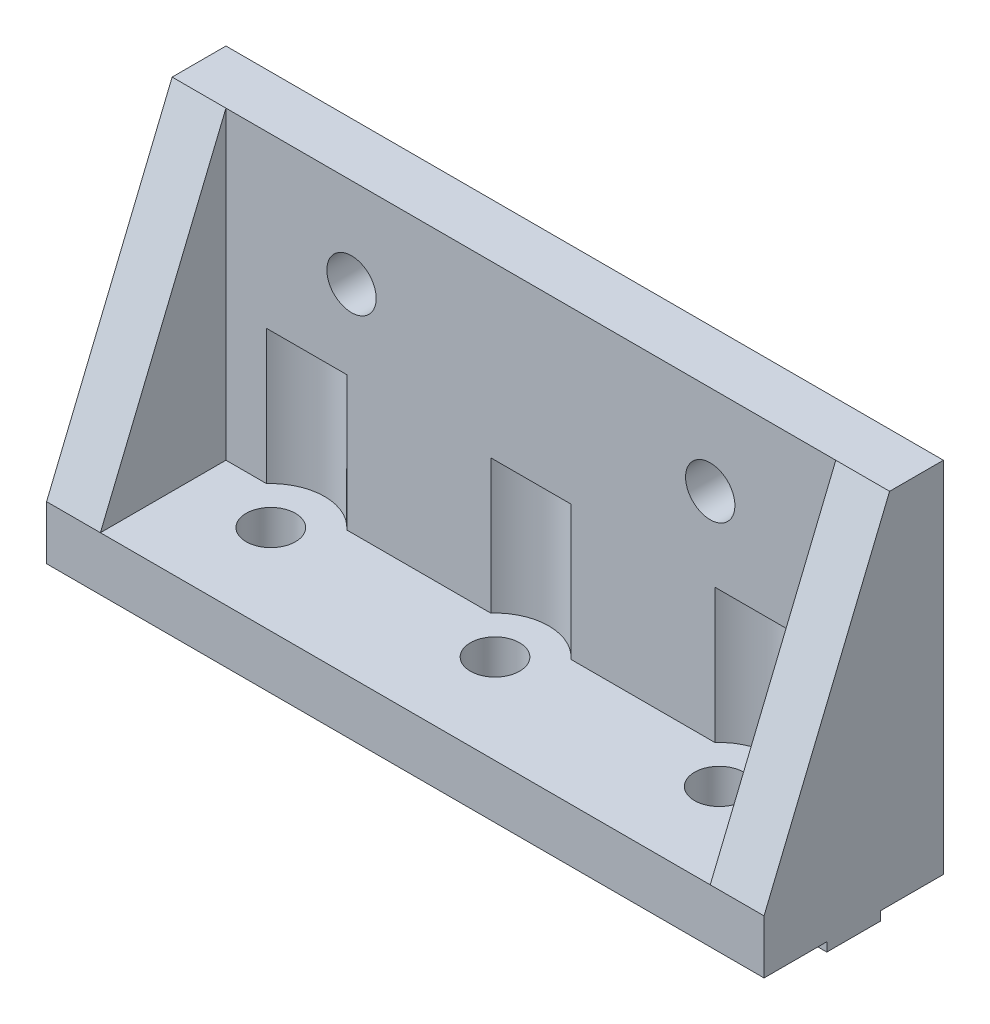
ISO-10303-21;
HEADER;
FILE_DESCRIPTION(('STEP AP214'),'2;1');
FILE_NAME('part.step','',(''),(''),'','','');
FILE_SCHEMA(('AUTOMOTIVE_DESIGN { 1 0 10303 214 1 1 1 1 }'));
ENDSEC;
DATA;
#1=APPLICATION_CONTEXT('core data for automotive mechanical design processes');
#2=APPLICATION_PROTOCOL_DEFINITION('international standard','automotive_design',2000,#1);
#3=PRODUCT_CONTEXT('',#1,'mechanical');
#4=PRODUCT('Part','Part','',(#3));
#5=PRODUCT_RELATED_PRODUCT_CATEGORY('part','',(#4));
#6=PRODUCT_DEFINITION_FORMATION('','',#4);
#7=PRODUCT_DEFINITION_CONTEXT('part definition',#1,'design');
#8=PRODUCT_DEFINITION('design','',#6,#7);
#9=PRODUCT_DEFINITION_SHAPE('','',#8);
#10=(LENGTH_UNIT() NAMED_UNIT(*) SI_UNIT(.MILLI.,.METRE.));
#11=(NAMED_UNIT(*) PLANE_ANGLE_UNIT() SI_UNIT($,.RADIAN.));
#12=(NAMED_UNIT(*) SI_UNIT($,.STERADIAN.) SOLID_ANGLE_UNIT());
#13=UNCERTAINTY_MEASURE_WITH_UNIT(LENGTH_MEASURE(1.E-05),#10,'distance_accuracy_value','');
#14=(GEOMETRIC_REPRESENTATION_CONTEXT(3) GLOBAL_UNCERTAINTY_ASSIGNED_CONTEXT((#13)) GLOBAL_UNIT_ASSIGNED_CONTEXT((#10,
#11,#12)) REPRESENTATION_CONTEXT('',''));
#15=CARTESIAN_POINT('',(0.,0.,0.));
#16=DIRECTION('',(0.,0.,1.));
#17=DIRECTION('',(1.,0.,0.));
#18=AXIS2_PLACEMENT_3D('',#15,#16,#17);
#19=CARTESIAN_POINT('',(6.,-34.,6.));
#20=DIRECTION('',(0.,0.,-1.));
#21=DIRECTION('',(-1.,0.,0.));
#22=AXIS2_PLACEMENT_3D('',#19,#20,#21);
#23=PLANE('',#22);
#24=CARTESIAN_POINT('',(20.,-10.,6.));
#25=DIRECTION('',(0.,0.,-1.));
#26=DIRECTION('',(-1.,0.,0.));
#27=AXIS2_PLACEMENT_3D('',#24,#25,#26);
#28=CIRCLE('',#27,2.75);
#29=CARTESIAN_POINT('',(17.25,-10.,6.));
#30=VERTEX_POINT('',#29);
#31=EDGE_CURVE('E303',#30,#30,#28,.F.);
#32=ORIENTED_EDGE('',*,*,#31,.F.);
#33=EDGE_LOOP('',(#32));
#34=FACE_BOUND('',#33,.T.);
#35=CARTESIAN_POINT('',(60.,-10.,6.));
#36=DIRECTION('',(0.,0.,-1.));
#37=DIRECTION('',(-1.,0.,0.));
#38=AXIS2_PLACEMENT_3D('',#35,#36,#37);
#39=CIRCLE('',#38,2.75000000000001);
#40=CARTESIAN_POINT('',(57.25,-10.,6.));
#41=VERTEX_POINT('',#40);
#42=EDGE_CURVE('E307',#41,#41,#39,.F.);
#43=ORIENTED_EDGE('',*,*,#42,.F.);
#44=EDGE_LOOP('',(#43));
#45=FACE_BOUND('',#44,.T.);
#46=DIRECTION('',(0.,-1.,0.));
#47=VECTOR('',#46,1.);
#48=CARTESIAN_POINT('',(19.4721359549996,-19.,6.));
#49=LINE('',#48,#47);
#50=CARTESIAN_POINT('',(19.4721359549996,-34.,6.));
#51=VERTEX_POINT('',#50);
#52=CARTESIAN_POINT('',(19.4721359549996,-19.,6.));
#53=VERTEX_POINT('',#52);
#54=EDGE_CURVE('E164',#51,#53,#49,.F.);
#55=ORIENTED_EDGE('',*,*,#54,.F.);
#56=DIRECTION('',(-1.,0.,0.));
#57=VECTOR('',#56,1.);
#58=CARTESIAN_POINT('',(6.,-34.,6.));
#59=LINE('',#58,#57);
#60=CARTESIAN_POINT('',(35.5278640450004,-34.,6.));
#61=VERTEX_POINT('',#60);
#62=EDGE_CURVE('E174',#61,#51,#59,.T.);
#63=ORIENTED_EDGE('',*,*,#62,.F.);
#64=DIRECTION('',(0.,-1.,0.));
#65=VECTOR('',#64,1.);
#66=CARTESIAN_POINT('',(35.5278640450004,-19.,6.));
#67=LINE('',#66,#65);
#68=CARTESIAN_POINT('',(35.5278640450004,-19.,6.));
#69=VERTEX_POINT('',#68);
#70=EDGE_CURVE('E235',#69,#61,#67,.T.);
#71=ORIENTED_EDGE('',*,*,#70,.F.);
#72=DIRECTION('',(1.,0.,0.));
#73=VECTOR('',#72,1.);
#74=CARTESIAN_POINT('',(6.,-19.,6.));
#75=LINE('',#74,#73);
#76=CARTESIAN_POINT('',(44.4721359549996,-19.,6.));
#77=VERTEX_POINT('',#76);
#78=EDGE_CURVE('E47',#69,#77,#75,.T.);
#79=ORIENTED_EDGE('',*,*,#78,.T.);
#80=DIRECTION('',(0.,-1.,0.));
#81=VECTOR('',#80,1.);
#82=CARTESIAN_POINT('',(44.4721359549996,-19.,6.));
#83=LINE('',#82,#81);
#84=CARTESIAN_POINT('',(44.4721359549996,-34.,6.));
#85=VERTEX_POINT('',#84);
#86=EDGE_CURVE('E234',#85,#77,#83,.F.);
#87=ORIENTED_EDGE('',*,*,#86,.F.);
#88=CARTESIAN_POINT('',(60.5278640450004,-34.,6.));
#89=VERTEX_POINT('',#88);
#90=EDGE_CURVE('E179',#89,#85,#59,.T.);
#91=ORIENTED_EDGE('',*,*,#90,.F.);
#92=DIRECTION('',(0.,-1.,0.));
#93=VECTOR('',#92,1.);
#94=CARTESIAN_POINT('',(60.5278640450004,-19.,6.));
#95=LINE('',#94,#93);
#96=CARTESIAN_POINT('',(60.5278640450004,-19.,6.));
#97=VERTEX_POINT('',#96);
#98=EDGE_CURVE('E251',#97,#89,#95,.T.);
#99=ORIENTED_EDGE('',*,*,#98,.F.);
#100=DIRECTION('',(1.,0.,0.));
#101=VECTOR('',#100,1.);
#102=CARTESIAN_POINT('',(6.,-19.,6.));
#103=LINE('',#102,#101);
#104=CARTESIAN_POINT('',(69.4721359549996,-19.,6.));
#105=VERTEX_POINT('',#104);
#106=EDGE_CURVE('E229',#97,#105,#103,.T.);
#107=ORIENTED_EDGE('',*,*,#106,.T.);
#108=DIRECTION('',(0.,-1.,0.));
#109=VECTOR('',#108,1.);
#110=CARTESIAN_POINT('',(69.4721359549996,-19.,6.));
#111=LINE('',#110,#109);
#112=CARTESIAN_POINT('',(69.4721359549996,-34.,6.));
#113=VERTEX_POINT('',#112);
#114=EDGE_CURVE('E254',#113,#105,#111,.F.);
#115=ORIENTED_EDGE('',*,*,#114,.F.);
#116=CARTESIAN_POINT('',(74.,-34.,6.));
#117=VERTEX_POINT('',#116);
#118=EDGE_CURVE('E182',#117,#113,#59,.T.);
#119=ORIENTED_EDGE('',*,*,#118,.F.);
#120=DIRECTION('',(0.,1.,0.));
#121=VECTOR('',#120,1.);
#122=CARTESIAN_POINT('',(74.,-34.,6.));
#123=LINE('',#122,#121);
#124=CARTESIAN_POINT('',(74.,0.,6.));
#125=VERTEX_POINT('',#124);
#126=EDGE_CURVE('E187',#117,#125,#123,.T.);
#127=ORIENTED_EDGE('',*,*,#126,.T.);
#128=DIRECTION('',(-1.,0.,0.));
#129=VECTOR('',#128,1.);
#130=CARTESIAN_POINT('',(6.,0.,6.));
#131=LINE('',#130,#129);
#132=CARTESIAN_POINT('',(6.00000000000003,0.,6.));
#133=VERTEX_POINT('',#132);
#134=EDGE_CURVE('E189',#125,#133,#131,.T.);
#135=ORIENTED_EDGE('',*,*,#134,.T.);
#136=DIRECTION('',(0.,1.,0.));
#137=VECTOR('',#136,1.);
#138=CARTESIAN_POINT('',(6.,-34.,6.));
#139=LINE('',#138,#137);
#140=CARTESIAN_POINT('',(6.,-34.,6.));
#141=VERTEX_POINT('',#140);
#142=EDGE_CURVE('E194',#141,#133,#139,.T.);
#143=ORIENTED_EDGE('',*,*,#142,.F.);
#144=CARTESIAN_POINT('',(10.5278640450004,-34.,6.));
#145=VERTEX_POINT('',#144);
#146=EDGE_CURVE('E180',#145,#141,#59,.T.);
#147=ORIENTED_EDGE('',*,*,#146,.F.);
#148=DIRECTION('',(0.,-1.,0.));
#149=VECTOR('',#148,1.);
#150=CARTESIAN_POINT('',(10.5278640450004,-19.,6.));
#151=LINE('',#150,#149);
#152=CARTESIAN_POINT('',(10.5278640450004,-19.,6.));
#153=VERTEX_POINT('',#152);
#154=EDGE_CURVE('E167',#153,#145,#151,.T.);
#155=ORIENTED_EDGE('',*,*,#154,.F.);
#156=DIRECTION('',(1.,0.,0.));
#157=VECTOR('',#156,1.);
#158=CARTESIAN_POINT('',(6.,-19.,6.));
#159=LINE('',#158,#157);
#160=EDGE_CURVE('E11',#153,#53,#159,.T.);
#161=ORIENTED_EDGE('',*,*,#160,.T.);
#162=EDGE_LOOP('',(#55,#63,#71,#79,#87,#91,#99,#107,#115,#119,#127,#135,#143,#147,#155,#161));
#163=FACE_BOUND('',#162,.T.);
#164=ADVANCED_FACE('F39',(#34,#45,#163),#23,.F.);
#165=CARTESIAN_POINT('',(0.,-40.,20.));
#166=DIRECTION('',(0.,1.,0.));
#167=DIRECTION('',(0.,0.,1.));
#168=AXIS2_PLACEMENT_3D('',#165,#166,#167);
#169=PLANE('',#168);
#170=DIRECTION('',(-1.,0.,0.));
#171=VECTOR('',#170,1.);
#172=CARTESIAN_POINT('',(0.,-40.,13.));
#173=LINE('',#172,#171);
#174=CARTESIAN_POINT('',(80.,-40.,13.));
#175=VERTEX_POINT('',#174);
#176=CARTESIAN_POINT('',(0.,-40.,13.));
#177=VERTEX_POINT('',#176);
#178=EDGE_CURVE('E281',#175,#177,#173,.T.);
#179=ORIENTED_EDGE('',*,*,#178,.F.);
#180=DIRECTION('',(0.,0.,-1.));
#181=VECTOR('',#180,1.);
#182=CARTESIAN_POINT('',(80.,-40.,20.));
#183=LINE('',#182,#181);
#184=CARTESIAN_POINT('',(80.,-40.,20.));
#185=VERTEX_POINT('',#184);
#186=EDGE_CURVE('E223',#185,#175,#183,.T.);
#187=ORIENTED_EDGE('',*,*,#186,.F.);
#188=DIRECTION('',(1.,0.,0.));
#189=VECTOR('',#188,1.);
#190=CARTESIAN_POINT('',(0.,-40.,20.));
#191=LINE('',#190,#189);
#192=CARTESIAN_POINT('',(0.,-40.,20.));
#193=VERTEX_POINT('',#192);
#194=EDGE_CURVE('E202',#193,#185,#191,.T.);
#195=ORIENTED_EDGE('',*,*,#194,.F.);
#196=DIRECTION('',(0.,0.,-1.));
#197=VECTOR('',#196,1.);
#198=CARTESIAN_POINT('',(0.,-40.,20.));
#199=LINE('',#198,#197);
#200=EDGE_CURVE('E227',#193,#177,#199,.T.);
#201=ORIENTED_EDGE('',*,*,#200,.T.);
#202=EDGE_LOOP('',(#179,#187,#195,#201));
#203=FACE_BOUND('',#202,.T.);
#204=ADVANCED_FACE('F360',(#203),#169,.F.);
#205=DIRECTION('',(1.,0.,0.));
#206=VECTOR('',#205,1.);
#207=CARTESIAN_POINT('',(0.,-40.,7.));
#208=LINE('',#207,#206);
#209=CARTESIAN_POINT('',(0.,-40.,7.));
#210=VERTEX_POINT('',#209);
#211=CARTESIAN_POINT('',(80.,-40.,7.));
#212=VERTEX_POINT('',#211);
#213=EDGE_CURVE('E276',#210,#212,#208,.T.);
#214=ORIENTED_EDGE('',*,*,#213,.F.);
#215=CARTESIAN_POINT('',(0.,-40.,0.));
#216=VERTEX_POINT('',#215);
#217=EDGE_CURVE('E226',#210,#216,#199,.T.);
#218=ORIENTED_EDGE('',*,*,#217,.T.);
#219=DIRECTION('',(1.,0.,0.));
#220=VECTOR('',#219,1.);
#221=CARTESIAN_POINT('',(0.,-40.,0.));
#222=LINE('',#221,#220);
#223=CARTESIAN_POINT('',(80.,-40.,0.));
#224=VERTEX_POINT('',#223);
#225=EDGE_CURVE('E211',#216,#224,#222,.T.);
#226=ORIENTED_EDGE('',*,*,#225,.T.);
#227=EDGE_CURVE('E222',#212,#224,#183,.T.);
#228=ORIENTED_EDGE('',*,*,#227,.F.);
#229=EDGE_LOOP('',(#214,#218,#226,#228));
#230=FACE_BOUND('',#229,.T.);
#231=ADVANCED_FACE('F366',(#230),#169,.F.);
#232=CARTESIAN_POINT('',(0.,0.,20.));
#233=DIRECTION('',(1.,0.,0.));
#234=DIRECTION('',(0.,1.,0.));
#235=AXIS2_PLACEMENT_3D('',#232,#233,#234);
#236=PLANE('',#235);
#237=DIRECTION('',(0.,-1.,0.));
#238=VECTOR('',#237,1.);
#239=CARTESIAN_POINT('',(0.,0.,20.));
#240=LINE('',#239,#238);
#241=CARTESIAN_POINT('',(0.,-34.,20.));
#242=VERTEX_POINT('',#241);
#243=EDGE_CURVE('E200',#242,#193,#240,.T.);
#244=ORIENTED_EDGE('',*,*,#243,.F.);
#245=DIRECTION('',(0.,-0.924678098474716,0.380749805254295));
#246=VECTOR('',#245,1.);
#247=CARTESIAN_POINT('',(0.,-34.,20.));
#248=LINE('',#247,#246);
#249=CARTESIAN_POINT('',(0.,0.,6.));
#250=VERTEX_POINT('',#249);
#251=EDGE_CURVE('E311',#250,#242,#248,.T.);
#252=ORIENTED_EDGE('',*,*,#251,.F.);
#253=DIRECTION('',(0.,0.,-1.));
#254=VECTOR('',#253,1.);
#255=CARTESIAN_POINT('',(0.,0.,20.));
#256=LINE('',#255,#254);
#257=CARTESIAN_POINT('',(0.,0.,0.));
#258=VERTEX_POINT('',#257);
#259=EDGE_CURVE('E208',#250,#258,#256,.T.);
#260=ORIENTED_EDGE('',*,*,#259,.T.);
#261=DIRECTION('',(0.,-1.,0.));
#262=VECTOR('',#261,1.);
#263=CARTESIAN_POINT('',(0.,0.,0.));
#264=LINE('',#263,#262);
#265=EDGE_CURVE('E197',#258,#216,#264,.T.);
#266=ORIENTED_EDGE('',*,*,#265,.T.);
#267=ORIENTED_EDGE('',*,*,#217,.F.);
#268=DIRECTION('',(0.,1.,0.));
#269=VECTOR('',#268,1.);
#270=CARTESIAN_POINT('',(0.,-41.,7.));
#271=LINE('',#270,#269);
#272=CARTESIAN_POINT('',(0.,-41.,7.));
#273=VERTEX_POINT('',#272);
#274=EDGE_CURVE('E300',#273,#210,#271,.T.);
#275=ORIENTED_EDGE('',*,*,#274,.F.);
#276=DIRECTION('',(0.,0.,-1.));
#277=VECTOR('',#276,1.);
#278=CARTESIAN_POINT('',(0.,-41.,13.));
#279=LINE('',#278,#277);
#280=CARTESIAN_POINT('',(0.,-41.,13.));
#281=VERTEX_POINT('',#280);
#282=EDGE_CURVE('E277',#281,#273,#279,.T.);
#283=ORIENTED_EDGE('',*,*,#282,.F.);
#284=DIRECTION('',(0.,1.,0.));
#285=VECTOR('',#284,1.);
#286=CARTESIAN_POINT('',(0.,-41.,13.));
#287=LINE('',#286,#285);
#288=EDGE_CURVE('E287',#281,#177,#287,.T.);
#289=ORIENTED_EDGE('',*,*,#288,.T.);
#290=ORIENTED_EDGE('',*,*,#200,.F.);
#291=EDGE_LOOP('',(#244,#252,#260,#266,#267,#275,#283,#289,#290));
#292=FACE_BOUND('',#291,.T.);
#293=ADVANCED_FACE('F41',(#292),#236,.F.);
#294=CARTESIAN_POINT('',(80.,0.,20.));
#295=DIRECTION('',(-1.,0.,0.));
#296=DIRECTION('',(0.,0.,1.));
#297=AXIS2_PLACEMENT_3D('',#294,#295,#296);
#298=PLANE('',#297);
#299=DIRECTION('',(0.,0.,-1.));
#300=VECTOR('',#299,1.);
#301=CARTESIAN_POINT('',(80.,0.,20.));
#302=LINE('',#301,#300);
#303=CARTESIAN_POINT('',(80.,0.,6.));
#304=VERTEX_POINT('',#303);
#305=CARTESIAN_POINT('',(80.,0.,0.));
#306=VERTEX_POINT('',#305);
#307=EDGE_CURVE('E220',#304,#306,#302,.T.);
#308=ORIENTED_EDGE('',*,*,#307,.F.);
#309=DIRECTION('',(0.,0.924678098474716,-0.380749805254295));
#310=VECTOR('',#309,1.);
#311=CARTESIAN_POINT('',(80.,-34.,20.));
#312=LINE('',#311,#310);
#313=CARTESIAN_POINT('',(80.,-34.,20.));
#314=VERTEX_POINT('',#313);
#315=EDGE_CURVE('E321',#314,#304,#312,.T.);
#316=ORIENTED_EDGE('',*,*,#315,.F.);
#317=DIRECTION('',(0.,1.,0.));
#318=VECTOR('',#317,1.);
#319=CARTESIAN_POINT('',(80.,0.,20.));
#320=LINE('',#319,#318);
#321=EDGE_CURVE('E205',#185,#314,#320,.T.);
#322=ORIENTED_EDGE('',*,*,#321,.F.);
#323=ORIENTED_EDGE('',*,*,#186,.T.);
#324=DIRECTION('',(0.,1.,0.));
#325=VECTOR('',#324,1.);
#326=CARTESIAN_POINT('',(80.,-41.,13.));
#327=LINE('',#326,#325);
#328=CARTESIAN_POINT('',(80.,-41.,13.));
#329=VERTEX_POINT('',#328);
#330=EDGE_CURVE('E294',#329,#175,#327,.T.);
#331=ORIENTED_EDGE('',*,*,#330,.F.);
#332=DIRECTION('',(0.,0.,1.));
#333=VECTOR('',#332,1.);
#334=CARTESIAN_POINT('',(80.,-41.,13.));
#335=LINE('',#334,#333);
#336=CARTESIAN_POINT('',(80.,-41.,7.));
#337=VERTEX_POINT('',#336);
#338=EDGE_CURVE('E283',#337,#329,#335,.T.);
#339=ORIENTED_EDGE('',*,*,#338,.F.);
#340=DIRECTION('',(0.,1.,0.));
#341=VECTOR('',#340,1.);
#342=CARTESIAN_POINT('',(80.,-41.,7.));
#343=LINE('',#342,#341);
#344=EDGE_CURVE('E297',#337,#212,#343,.T.);
#345=ORIENTED_EDGE('',*,*,#344,.T.);
#346=ORIENTED_EDGE('',*,*,#227,.T.);
#347=DIRECTION('',(0.,1.,0.));
#348=VECTOR('',#347,1.);
#349=CARTESIAN_POINT('',(80.,0.,0.));
#350=LINE('',#349,#348);
#351=EDGE_CURVE('E214',#224,#306,#350,.T.);
#352=ORIENTED_EDGE('',*,*,#351,.T.);
#353=EDGE_LOOP('',(#308,#316,#322,#323,#331,#339,#345,#346,#352));
#354=FACE_BOUND('',#353,.T.);
#355=ADVANCED_FACE('F391',(#354),#298,.F.);
#356=CARTESIAN_POINT('',(0.,0.,20.));
#357=DIRECTION('',(0.,-1.,0.));
#358=DIRECTION('',(0.,0.,-1.));
#359=AXIS2_PLACEMENT_3D('',#356,#357,#358);
#360=PLANE('',#359);
#361=ORIENTED_EDGE('',*,*,#259,.F.);
#362=DIRECTION('',(-1.,0.,0.));
#363=VECTOR('',#362,1.);
#364=CARTESIAN_POINT('',(116.7695526217,0.,6.));
#365=LINE('',#364,#363);
#366=EDGE_CURVE('E317',#133,#250,#365,.T.);
#367=ORIENTED_EDGE('',*,*,#366,.F.);
#368=ORIENTED_EDGE('',*,*,#134,.F.);
#369=EDGE_CURVE('E323',#304,#125,#365,.T.);
#370=ORIENTED_EDGE('',*,*,#369,.F.);
#371=ORIENTED_EDGE('',*,*,#307,.T.);
#372=DIRECTION('',(-1.,0.,0.));
#373=VECTOR('',#372,1.);
#374=CARTESIAN_POINT('',(0.,0.,0.));
#375=LINE('',#374,#373);
#376=EDGE_CURVE('E203',#306,#258,#375,.T.);
#377=ORIENTED_EDGE('',*,*,#376,.T.);
#378=EDGE_LOOP('',(#361,#367,#368,#370,#371,#377));
#379=FACE_BOUND('',#378,.T.);
#380=ADVANCED_FACE('F384',(#379),#360,.F.);
#381=CARTESIAN_POINT('',(0.,0.,20.));
#382=DIRECTION('',(0.,0.,1.));
#383=DIRECTION('',(1.,0.,0.));
#384=AXIS2_PLACEMENT_3D('',#381,#382,#383);
#385=PLANE('',#384);
#386=DIRECTION('',(-1.,0.,0.));
#387=VECTOR('',#386,1.);
#388=CARTESIAN_POINT('',(116.7695526217,-34.,20.));
#389=LINE('',#388,#387);
#390=CARTESIAN_POINT('',(6.,-34.,20.));
#391=VERTEX_POINT('',#390);
#392=EDGE_CURVE('E322',#391,#242,#389,.T.);
#393=ORIENTED_EDGE('',*,*,#392,.T.);
#394=ORIENTED_EDGE('',*,*,#243,.T.);
#395=ORIENTED_EDGE('',*,*,#194,.T.);
#396=ORIENTED_EDGE('',*,*,#321,.T.);
#397=CARTESIAN_POINT('',(74.,-34.,20.));
#398=VERTEX_POINT('',#397);
#399=EDGE_CURVE('E318',#314,#398,#389,.T.);
#400=ORIENTED_EDGE('',*,*,#399,.T.);
#401=DIRECTION('',(1.,0.,0.));
#402=VECTOR('',#401,1.);
#403=CARTESIAN_POINT('',(6.00000000000001,-34.,20.));
#404=LINE('',#403,#402);
#405=EDGE_CURVE('E332',#391,#398,#404,.T.);
#406=ORIENTED_EDGE('',*,*,#405,.F.);
#407=EDGE_LOOP('',(#393,#394,#395,#396,#400,#406));
#408=FACE_BOUND('',#407,.T.);
#409=ADVANCED_FACE('F381',(#408),#385,.T.);
#410=CARTESIAN_POINT('',(0.,0.,0.));
#411=DIRECTION('',(0.,0.,1.));
#412=DIRECTION('',(1.,0.,0.));
#413=AXIS2_PLACEMENT_3D('',#410,#411,#412);
#414=PLANE('',#413);
#415=CARTESIAN_POINT('',(60.,-10.,0.));
#416=DIRECTION('',(0.,0.,-1.));
#417=DIRECTION('',(-1.,0.,0.));
#418=AXIS2_PLACEMENT_3D('',#415,#416,#417);
#419=CIRCLE('',#418,2.75000000000001);
#420=CARTESIAN_POINT('',(57.25,-10.,0.));
#421=VERTEX_POINT('',#420);
#422=EDGE_CURVE('E304',#421,#421,#419,.T.);
#423=ORIENTED_EDGE('',*,*,#422,.F.);
#424=EDGE_LOOP('',(#423));
#425=FACE_BOUND('',#424,.T.);
#426=CARTESIAN_POINT('',(20.,-10.,0.));
#427=DIRECTION('',(0.,0.,-1.));
#428=DIRECTION('',(-1.,0.,0.));
#429=AXIS2_PLACEMENT_3D('',#426,#427,#428);
#430=CIRCLE('',#429,2.75);
#431=CARTESIAN_POINT('',(17.25,-10.,0.));
#432=VERTEX_POINT('',#431);
#433=EDGE_CURVE('E308',#432,#432,#430,.T.);
#434=ORIENTED_EDGE('',*,*,#433,.F.);
#435=EDGE_LOOP('',(#434));
#436=FACE_BOUND('',#435,.T.);
#437=ORIENTED_EDGE('',*,*,#265,.F.);
#438=ORIENTED_EDGE('',*,*,#376,.F.);
#439=ORIENTED_EDGE('',*,*,#351,.F.);
#440=ORIENTED_EDGE('',*,*,#225,.F.);
#441=EDGE_LOOP('',(#437,#438,#439,#440));
#442=FACE_BOUND('',#441,.T.);
#443=ADVANCED_FACE('F379',(#425,#436,#442),#414,.F.);
#444=CARTESIAN_POINT('',(6.00000000000001,-34.,20.));
#445=DIRECTION('',(-1.,0.,0.));
#446=DIRECTION('',(0.,0.,1.));
#447=AXIS2_PLACEMENT_3D('',#444,#445,#446);
#448=PLANE('',#447);
#449=ORIENTED_EDGE('',*,*,#142,.T.);
#450=DIRECTION('',(0.,-0.924678098474716,0.380749805254295));
#451=VECTOR('',#450,1.);
#452=CARTESIAN_POINT('',(6.00000000000001,-34.,20.));
#453=LINE('',#452,#451);
#454=EDGE_CURVE('E193',#133,#391,#453,.T.);
#455=ORIENTED_EDGE('',*,*,#454,.T.);
#456=DIRECTION('',(0.,0.,1.));
#457=VECTOR('',#456,1.);
#458=CARTESIAN_POINT('',(6.00000000000001,-34.,20.));
#459=LINE('',#458,#457);
#460=EDGE_CURVE('E192',#141,#391,#459,.T.);
#461=ORIENTED_EDGE('',*,*,#460,.F.);
#462=EDGE_LOOP('',(#449,#455,#461));
#463=FACE_BOUND('',#462,.T.);
#464=ADVANCED_FACE('F376',(#463),#448,.F.);
#465=CARTESIAN_POINT('',(74.,-34.,20.));
#466=DIRECTION('',(1.,0.,0.));
#467=DIRECTION('',(0.,0.,-1.));
#468=AXIS2_PLACEMENT_3D('',#465,#466,#467);
#469=PLANE('',#468);
#470=DIRECTION('',(0.,0.,-1.));
#471=VECTOR('',#470,1.);
#472=CARTESIAN_POINT('',(74.,-34.,20.));
#473=LINE('',#472,#471);
#474=EDGE_CURVE('E183',#398,#117,#473,.T.);
#475=ORIENTED_EDGE('',*,*,#474,.F.);
#476=DIRECTION('',(0.,0.924678098474716,-0.380749805254295));
#477=VECTOR('',#476,1.);
#478=CARTESIAN_POINT('',(74.,-34.,20.));
#479=LINE('',#478,#477);
#480=EDGE_CURVE('E326',#398,#125,#479,.T.);
#481=ORIENTED_EDGE('',*,*,#480,.T.);
#482=ORIENTED_EDGE('',*,*,#126,.F.);
#483=EDGE_LOOP('',(#475,#481,#482));
#484=FACE_BOUND('',#483,.T.);
#485=ADVANCED_FACE('F373',(#484),#469,.F.);
#486=CARTESIAN_POINT('',(0.,-34.,0.));
#487=DIRECTION('',(0.,-1.,0.));
#488=DIRECTION('',(0.,0.,-1.));
#489=AXIS2_PLACEMENT_3D('',#486,#487,#488);
#490=PLANE('',#489);
#491=ORIENTED_EDGE('',*,*,#62,.T.);
#492=CARTESIAN_POINT('',(15.,-34.,10.));
#493=DIRECTION('',(0.,1.,0.));
#494=DIRECTION('',(0.,0.,1.));
#495=AXIS2_PLACEMENT_3D('',#492,#493,#494);
#496=CIRCLE('',#495,6.);
#497=EDGE_CURVE('E54',#51,#145,#496,.T.);
#498=ORIENTED_EDGE('',*,*,#497,.T.);
#499=ORIENTED_EDGE('',*,*,#146,.T.);
#500=ORIENTED_EDGE('',*,*,#460,.T.);
#501=ORIENTED_EDGE('',*,*,#405,.T.);
#502=ORIENTED_EDGE('',*,*,#474,.T.);
#503=ORIENTED_EDGE('',*,*,#118,.T.);
#504=CARTESIAN_POINT('',(65.,-34.,10.));
#505=DIRECTION('',(0.,1.,0.));
#506=DIRECTION('',(0.,0.,1.));
#507=AXIS2_PLACEMENT_3D('',#504,#505,#506);
#508=CIRCLE('',#507,6.);
#509=EDGE_CURVE('E243',#113,#89,#508,.T.);
#510=ORIENTED_EDGE('',*,*,#509,.T.);
#511=ORIENTED_EDGE('',*,*,#90,.T.);
#512=CARTESIAN_POINT('',(40.,-34.,10.));
#513=DIRECTION('',(0.,1.,0.));
#514=DIRECTION('',(0.,0.,1.));
#515=AXIS2_PLACEMENT_3D('',#512,#513,#514);
#516=CIRCLE('',#515,5.99999999999999);
#517=EDGE_CURVE('E60',#85,#61,#516,.T.);
#518=ORIENTED_EDGE('',*,*,#517,.T.);
#519=EDGE_LOOP('',(#491,#498,#499,#500,#501,#502,#503,#510,#511,#518));
#520=FACE_BOUND('',#519,.T.);
#521=CARTESIAN_POINT('',(65.,-34.,10.));
#522=DIRECTION('',(0.,-1.,0.));
#523=DIRECTION('',(0.,0.,-1.));
#524=AXIS2_PLACEMENT_3D('',#521,#522,#523);
#525=CIRCLE('',#524,2.75000000000001);
#526=CARTESIAN_POINT('',(65.,-34.,7.25));
#527=VERTEX_POINT('',#526);
#528=EDGE_CURVE('E262',#527,#527,#525,.T.);
#529=ORIENTED_EDGE('',*,*,#528,.T.);
#530=EDGE_LOOP('',(#529));
#531=FACE_BOUND('',#530,.T.);
#532=CARTESIAN_POINT('',(40.,-34.,10.));
#533=DIRECTION('',(0.,-1.,0.));
#534=DIRECTION('',(0.,0.,-1.));
#535=AXIS2_PLACEMENT_3D('',#532,#533,#534);
#536=CIRCLE('',#535,2.75);
#537=CARTESIAN_POINT('',(40.,-34.,7.25));
#538=VERTEX_POINT('',#537);
#539=EDGE_CURVE('E270',#538,#538,#536,.T.);
#540=ORIENTED_EDGE('',*,*,#539,.T.);
#541=EDGE_LOOP('',(#540));
#542=FACE_BOUND('',#541,.T.);
#543=CARTESIAN_POINT('',(15.,-34.,10.));
#544=DIRECTION('',(0.,-1.,0.));
#545=DIRECTION('',(0.,0.,-1.));
#546=AXIS2_PLACEMENT_3D('',#543,#544,#545);
#547=CIRCLE('',#546,2.75);
#548=CARTESIAN_POINT('',(15.,-34.,7.25000000000001));
#549=VERTEX_POINT('',#548);
#550=EDGE_CURVE('E273',#549,#549,#547,.T.);
#551=ORIENTED_EDGE('',*,*,#550,.T.);
#552=EDGE_LOOP('',(#551));
#553=FACE_BOUND('',#552,.T.);
#554=ADVANCED_FACE('F177',(#520,#531,#542,#553),#490,.F.);
#555=CARTESIAN_POINT('',(116.7695526217,-34.,20.));
#556=DIRECTION('',(0.,-0.380749805254295,-0.924678098474716));
#557=DIRECTION('',(0.,0.924678098474716,-0.380749805254295));
#558=AXIS2_PLACEMENT_3D('',#555,#556,#557);
#559=PLANE('',#558);
#560=ORIENTED_EDGE('',*,*,#399,.F.);
#561=ORIENTED_EDGE('',*,*,#315,.T.);
#562=ORIENTED_EDGE('',*,*,#369,.T.);
#563=ORIENTED_EDGE('',*,*,#480,.F.);
#564=EDGE_LOOP('',(#560,#561,#562,#563));
#565=FACE_BOUND('',#564,.T.);
#566=ADVANCED_FACE('F410',(#565),#559,.F.);
#567=ORIENTED_EDGE('',*,*,#366,.T.);
#568=ORIENTED_EDGE('',*,*,#251,.T.);
#569=ORIENTED_EDGE('',*,*,#392,.F.);
#570=ORIENTED_EDGE('',*,*,#454,.F.);
#571=EDGE_LOOP('',(#567,#568,#569,#570));
#572=FACE_BOUND('',#571,.T.);
#573=ADVANCED_FACE('F436',(#572),#559,.F.);
#574=CARTESIAN_POINT('',(20.,-10.,20.001));
#575=DIRECTION('',(0.,0.,-1.));
#576=DIRECTION('',(-1.,0.,0.));
#577=AXIS2_PLACEMENT_3D('',#574,#575,#576);
#578=CYLINDRICAL_SURFACE('',#577,2.75);
#579=ORIENTED_EDGE('',*,*,#433,.T.);
#580=EDGE_LOOP('',(#579));
#581=FACE_BOUND('',#580,.T.);
#582=ORIENTED_EDGE('',*,*,#31,.T.);
#583=EDGE_LOOP('',(#582));
#584=FACE_BOUND('',#583,.T.);
#585=ADVANCED_FACE('F439',(#581,#584),#578,.F.);
#586=CARTESIAN_POINT('',(60.,-10.,20.001));
#587=DIRECTION('',(0.,0.,-1.));
#588=DIRECTION('',(-1.,0.,0.));
#589=AXIS2_PLACEMENT_3D('',#586,#587,#588);
#590=CYLINDRICAL_SURFACE('',#589,2.75000000000001);
#591=ORIENTED_EDGE('',*,*,#422,.T.);
#592=EDGE_LOOP('',(#591));
#593=FACE_BOUND('',#592,.T.);
#594=ORIENTED_EDGE('',*,*,#42,.T.);
#595=EDGE_LOOP('',(#594));
#596=FACE_BOUND('',#595,.T.);
#597=ADVANCED_FACE('F444',(#593,#596),#590,.F.);
#598=CARTESIAN_POINT('',(0.,-41.,7.));
#599=DIRECTION('',(0.,0.,1.));
#600=DIRECTION('',(1.,0.,0.));
#601=AXIS2_PLACEMENT_3D('',#598,#599,#600);
#602=PLANE('',#601);
#603=ORIENTED_EDGE('',*,*,#213,.T.);
#604=ORIENTED_EDGE('',*,*,#344,.F.);
#605=DIRECTION('',(1.,0.,0.));
#606=VECTOR('',#605,1.);
#607=CARTESIAN_POINT('',(0.,-41.,7.));
#608=LINE('',#607,#606);
#609=EDGE_CURVE('E280',#273,#337,#608,.T.);
#610=ORIENTED_EDGE('',*,*,#609,.F.);
#611=ORIENTED_EDGE('',*,*,#274,.T.);
#612=EDGE_LOOP('',(#603,#604,#610,#611));
#613=FACE_BOUND('',#612,.T.);
#614=ADVANCED_FACE('F426',(#613),#602,.F.);
#615=CARTESIAN_POINT('',(0.,-41.,13.));
#616=DIRECTION('',(0.,0.,-1.));
#617=DIRECTION('',(-1.,0.,0.));
#618=AXIS2_PLACEMENT_3D('',#615,#616,#617);
#619=PLANE('',#618);
#620=ORIENTED_EDGE('',*,*,#178,.T.);
#621=ORIENTED_EDGE('',*,*,#288,.F.);
#622=DIRECTION('',(-1.,0.,0.));
#623=VECTOR('',#622,1.);
#624=CARTESIAN_POINT('',(0.,-41.,13.));
#625=LINE('',#624,#623);
#626=EDGE_CURVE('E285',#329,#281,#625,.T.);
#627=ORIENTED_EDGE('',*,*,#626,.F.);
#628=ORIENTED_EDGE('',*,*,#330,.T.);
#629=EDGE_LOOP('',(#620,#621,#627,#628));
#630=FACE_BOUND('',#629,.T.);
#631=ADVANCED_FACE('F418',(#630),#619,.F.);
#632=CARTESIAN_POINT('',(0.,-41.,0.));
#633=DIRECTION('',(0.,-1.,0.));
#634=DIRECTION('',(0.,0.,-1.));
#635=AXIS2_PLACEMENT_3D('',#632,#633,#634);
#636=PLANE('',#635);
#637=CARTESIAN_POINT('',(15.,-41.,10.));
#638=DIRECTION('',(0.,-1.,0.));
#639=DIRECTION('',(0.,0.,-1.));
#640=AXIS2_PLACEMENT_3D('',#637,#638,#639);
#641=CIRCLE('',#640,2.75);
#642=CARTESIAN_POINT('',(15.,-41.,7.25000000000001));
#643=VERTEX_POINT('',#642);
#644=EDGE_CURVE('E259',#643,#643,#641,.T.);
#645=ORIENTED_EDGE('',*,*,#644,.F.);
#646=EDGE_LOOP('',(#645));
#647=FACE_BOUND('',#646,.T.);
#648=CARTESIAN_POINT('',(40.,-41.,10.));
#649=DIRECTION('',(0.,-1.,0.));
#650=DIRECTION('',(0.,0.,-1.));
#651=AXIS2_PLACEMENT_3D('',#648,#649,#650);
#652=CIRCLE('',#651,2.75);
#653=CARTESIAN_POINT('',(40.,-41.,7.25));
#654=VERTEX_POINT('',#653);
#655=EDGE_CURVE('E263',#654,#654,#652,.T.);
#656=ORIENTED_EDGE('',*,*,#655,.F.);
#657=EDGE_LOOP('',(#656));
#658=FACE_BOUND('',#657,.T.);
#659=CARTESIAN_POINT('',(65.,-41.,10.));
#660=DIRECTION('',(0.,-1.,0.));
#661=DIRECTION('',(0.,0.,-1.));
#662=AXIS2_PLACEMENT_3D('',#659,#660,#661);
#663=CIRCLE('',#662,2.75000000000001);
#664=CARTESIAN_POINT('',(65.,-41.,7.25));
#665=VERTEX_POINT('',#664);
#666=EDGE_CURVE('E175',#665,#665,#663,.T.);
#667=ORIENTED_EDGE('',*,*,#666,.F.);
#668=EDGE_LOOP('',(#667));
#669=FACE_BOUND('',#668,.T.);
#670=ORIENTED_EDGE('',*,*,#282,.T.);
#671=ORIENTED_EDGE('',*,*,#609,.T.);
#672=ORIENTED_EDGE('',*,*,#338,.T.);
#673=ORIENTED_EDGE('',*,*,#626,.T.);
#674=EDGE_LOOP('',(#670,#671,#672,#673));
#675=FACE_BOUND('',#674,.T.);
#676=ADVANCED_FACE('F422',(#647,#658,#669,#675),#636,.T.);
#677=CARTESIAN_POINT('',(65.,0.,10.));
#678=DIRECTION('',(0.,-1.,0.));
#679=DIRECTION('',(0.,0.,-1.));
#680=AXIS2_PLACEMENT_3D('',#677,#678,#679);
#681=CYLINDRICAL_SURFACE('',#680,2.75000000000001);
#682=ORIENTED_EDGE('',*,*,#666,.T.);
#683=EDGE_LOOP('',(#682));
#684=FACE_BOUND('',#683,.T.);
#685=ORIENTED_EDGE('',*,*,#528,.F.);
#686=EDGE_LOOP('',(#685));
#687=FACE_BOUND('',#686,.T.);
#688=ADVANCED_FACE('F456',(#684,#687),#681,.F.);
#689=CARTESIAN_POINT('',(40.,0.,10.));
#690=DIRECTION('',(0.,-1.,0.));
#691=DIRECTION('',(0.,0.,-1.));
#692=AXIS2_PLACEMENT_3D('',#689,#690,#691);
#693=CYLINDRICAL_SURFACE('',#692,2.75);
#694=ORIENTED_EDGE('',*,*,#655,.T.);
#695=EDGE_LOOP('',(#694));
#696=FACE_BOUND('',#695,.T.);
#697=ORIENTED_EDGE('',*,*,#539,.F.);
#698=EDGE_LOOP('',(#697));
#699=FACE_BOUND('',#698,.T.);
#700=ADVANCED_FACE('F356',(#696,#699),#693,.F.);
#701=CARTESIAN_POINT('',(15.,0.,10.));
#702=DIRECTION('',(0.,-1.,0.));
#703=DIRECTION('',(0.,0.,-1.));
#704=AXIS2_PLACEMENT_3D('',#701,#702,#703);
#705=CYLINDRICAL_SURFACE('',#704,2.75);
#706=ORIENTED_EDGE('',*,*,#644,.T.);
#707=EDGE_LOOP('',(#706));
#708=FACE_BOUND('',#707,.T.);
#709=ORIENTED_EDGE('',*,*,#550,.F.);
#710=EDGE_LOOP('',(#709));
#711=FACE_BOUND('',#710,.T.);
#712=ADVANCED_FACE('F348',(#708,#711),#705,.F.);
#713=CARTESIAN_POINT('',(65.,-19.,10.));
#714=DIRECTION('',(0.,1.,0.));
#715=DIRECTION('',(0.,0.,1.));
#716=AXIS2_PLACEMENT_3D('',#713,#714,#715);
#717=PLANE('',#716);
#718=CARTESIAN_POINT('',(65.,-19.,10.));
#719=DIRECTION('',(0.,1.,0.));
#720=DIRECTION('',(0.,0.,1.));
#721=AXIS2_PLACEMENT_3D('',#718,#719,#720);
#722=CIRCLE('',#721,6.);
#723=EDGE_CURVE('E246',#105,#97,#722,.T.);
#724=ORIENTED_EDGE('',*,*,#723,.F.);
#725=ORIENTED_EDGE('',*,*,#106,.F.);
#726=EDGE_LOOP('',(#724,#725));
#727=FACE_BOUND('',#726,.T.);
#728=ADVANCED_FACE('F346',(#727),#717,.F.);
#729=CARTESIAN_POINT('',(65.,-19.,10.));
#730=DIRECTION('',(0.,-1.,0.));
#731=DIRECTION('',(0.,0.,-1.));
#732=AXIS2_PLACEMENT_3D('',#729,#730,#731);
#733=CYLINDRICAL_SURFACE('',#732,6.);
#734=ORIENTED_EDGE('',*,*,#114,.T.);
#735=ORIENTED_EDGE('',*,*,#723,.T.);
#736=ORIENTED_EDGE('',*,*,#98,.T.);
#737=ORIENTED_EDGE('',*,*,#509,.F.);
#738=EDGE_LOOP('',(#734,#735,#736,#737));
#739=FACE_BOUND('',#738,.T.);
#740=ADVANCED_FACE('F344',(#739),#733,.F.);
#741=CARTESIAN_POINT('',(40.,-19.,10.));
#742=DIRECTION('',(0.,1.,0.));
#743=DIRECTION('',(0.,0.,1.));
#744=AXIS2_PLACEMENT_3D('',#741,#742,#743);
#745=PLANE('',#744);
#746=CARTESIAN_POINT('',(40.,-19.,10.));
#747=DIRECTION('',(0.,1.,0.));
#748=DIRECTION('',(0.,0.,1.));
#749=AXIS2_PLACEMENT_3D('',#746,#747,#748);
#750=CIRCLE('',#749,5.99999999999999);
#751=EDGE_CURVE('E240',#77,#69,#750,.T.);
#752=ORIENTED_EDGE('',*,*,#751,.F.);
#753=ORIENTED_EDGE('',*,*,#78,.F.);
#754=EDGE_LOOP('',(#752,#753));
#755=FACE_BOUND('',#754,.T.);
#756=ADVANCED_FACE('F239',(#755),#745,.F.);
#757=CARTESIAN_POINT('',(40.,-19.,10.));
#758=DIRECTION('',(0.,-1.,0.));
#759=DIRECTION('',(0.,0.,-1.));
#760=AXIS2_PLACEMENT_3D('',#757,#758,#759);
#761=CYLINDRICAL_SURFACE('',#760,5.99999999999999);
#762=ORIENTED_EDGE('',*,*,#86,.T.);
#763=ORIENTED_EDGE('',*,*,#751,.T.);
#764=ORIENTED_EDGE('',*,*,#70,.T.);
#765=ORIENTED_EDGE('',*,*,#517,.F.);
#766=EDGE_LOOP('',(#762,#763,#764,#765));
#767=FACE_BOUND('',#766,.T.);
#768=ADVANCED_FACE('F242',(#767),#761,.F.);
#769=CARTESIAN_POINT('',(15.,-19.,10.));
#770=DIRECTION('',(0.,1.,0.));
#771=DIRECTION('',(0.,0.,1.));
#772=AXIS2_PLACEMENT_3D('',#769,#770,#771);
#773=PLANE('',#772);
#774=CARTESIAN_POINT('',(15.,-19.,10.));
#775=DIRECTION('',(0.,1.,0.));
#776=DIRECTION('',(0.,0.,1.));
#777=AXIS2_PLACEMENT_3D('',#774,#775,#776);
#778=CIRCLE('',#777,6.);
#779=EDGE_CURVE('E169',#53,#153,#778,.T.);
#780=ORIENTED_EDGE('',*,*,#779,.F.);
#781=ORIENTED_EDGE('',*,*,#160,.F.);
#782=EDGE_LOOP('',(#780,#781));
#783=FACE_BOUND('',#782,.T.);
#784=ADVANCED_FACE('F510',(#783),#773,.F.);
#785=CARTESIAN_POINT('',(15.,-19.,10.));
#786=DIRECTION('',(0.,-1.,0.));
#787=DIRECTION('',(0.,0.,-1.));
#788=AXIS2_PLACEMENT_3D('',#785,#786,#787);
#789=CYLINDRICAL_SURFACE('',#788,6.);
#790=ORIENTED_EDGE('',*,*,#54,.T.);
#791=ORIENTED_EDGE('',*,*,#779,.T.);
#792=ORIENTED_EDGE('',*,*,#154,.T.);
#793=ORIENTED_EDGE('',*,*,#497,.F.);
#794=EDGE_LOOP('',(#790,#791,#792,#793));
#795=FACE_BOUND('',#794,.T.);
#796=ADVANCED_FACE('F162',(#795),#789,.F.);
#797=CLOSED_SHELL('',(#164,#204,#231,#293,#355,#380,#409,#443,#464,#485,#554,#566,#573,#585,
#597,#614,#631,#676,#688,#700,#712,#728,#740,#756,#768,#784,#796));
#798=MANIFOLD_SOLID_BREP('B2',#797);
#799=ADVANCED_BREP_SHAPE_REPRESENTATION('',(#18,#798),#14);
#800=SHAPE_DEFINITION_REPRESENTATION(#9,#799);
ENDSEC;
END-ISO-10303-21;
